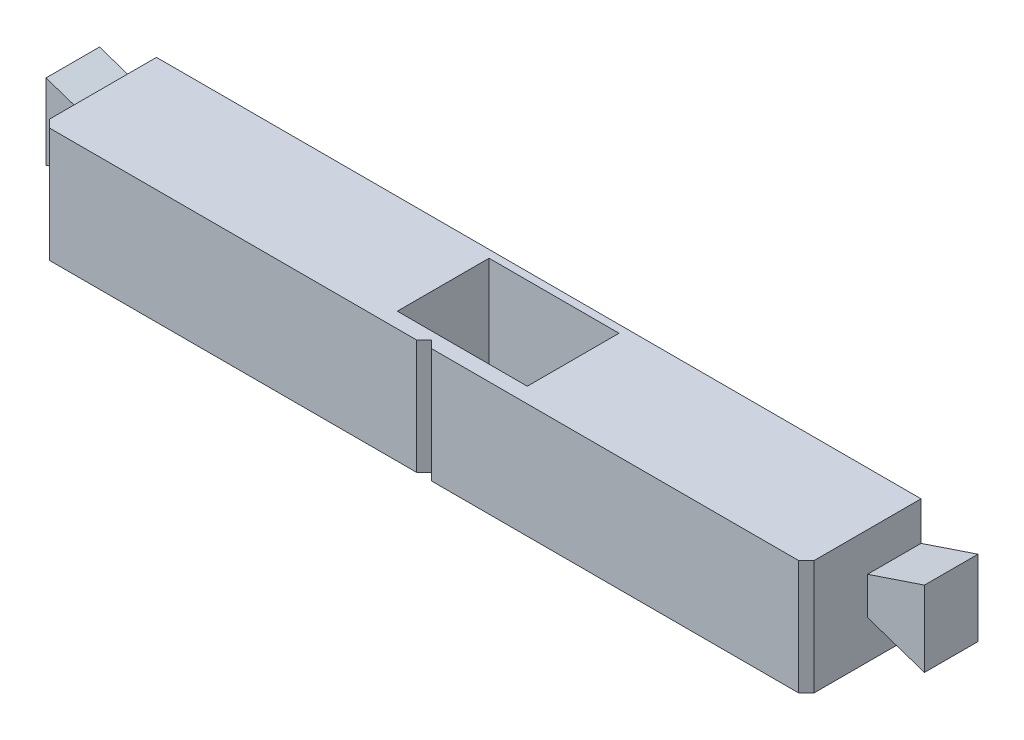
ISO-10303-21;
HEADER;
FILE_DESCRIPTION(('STEP AP214'),'2;1');
FILE_NAME('part.step','',(''),(''),'','','');
FILE_SCHEMA(('AUTOMOTIVE_DESIGN { 1 0 10303 214 1 1 1 1 }'));
ENDSEC;
DATA;
#1=APPLICATION_CONTEXT('core data for automotive mechanical design processes');
#2=APPLICATION_PROTOCOL_DEFINITION('international standard','automotive_design',2000,#1);
#3=PRODUCT_CONTEXT('',#1,'mechanical');
#4=PRODUCT('Part','Part','',(#3));
#5=PRODUCT_RELATED_PRODUCT_CATEGORY('part','',(#4));
#6=PRODUCT_DEFINITION_FORMATION('','',#4);
#7=PRODUCT_DEFINITION_CONTEXT('part definition',#1,'design');
#8=PRODUCT_DEFINITION('design','',#6,#7);
#9=PRODUCT_DEFINITION_SHAPE('','',#8);
#10=(LENGTH_UNIT() NAMED_UNIT(*) SI_UNIT(.MILLI.,.METRE.));
#11=(NAMED_UNIT(*) PLANE_ANGLE_UNIT() SI_UNIT($,.RADIAN.));
#12=(NAMED_UNIT(*) SI_UNIT($,.STERADIAN.) SOLID_ANGLE_UNIT());
#13=UNCERTAINTY_MEASURE_WITH_UNIT(LENGTH_MEASURE(1.E-05),#10,'distance_accuracy_value','');
#14=(GEOMETRIC_REPRESENTATION_CONTEXT(3) GLOBAL_UNCERTAINTY_ASSIGNED_CONTEXT((#13)) GLOBAL_UNIT_ASSIGNED_CONTEXT((#10,
#11,#12)) REPRESENTATION_CONTEXT('',''));
#15=CARTESIAN_POINT('',(0.,0.,0.));
#16=DIRECTION('',(0.,0.,1.));
#17=DIRECTION('',(1.,0.,0.));
#18=AXIS2_PLACEMENT_3D('',#15,#16,#17);
#19=CARTESIAN_POINT('',(5.50000000000003,-7.5,13.));
#20=DIRECTION('',(1.,0.,0.));
#21=DIRECTION('',(0.,0.,-1.));
#22=AXIS2_PLACEMENT_3D('',#19,#20,#21);
#23=PLANE('',#22);
#24=DIRECTION('',(0.,0.,1.));
#25=VECTOR('',#24,1.);
#26=CARTESIAN_POINT('',(5.50000000000003,-1.5,13.));
#27=LINE('',#26,#25);
#28=CARTESIAN_POINT('',(5.50000000000003,-1.5,0.999999999999997));
#29=VERTEX_POINT('',#28);
#30=CARTESIAN_POINT('',(5.50000000000003,-1.5,13.));
#31=VERTEX_POINT('',#30);
#32=EDGE_CURVE('E202',#29,#31,#27,.T.);
#33=ORIENTED_EDGE('',*,*,#32,.F.);
#34=DIRECTION('',(0.,1.,0.));
#35=VECTOR('',#34,1.);
#36=CARTESIAN_POINT('',(5.50000000000003,-7.5,0.999999999999997));
#37=LINE('',#36,#35);
#38=CARTESIAN_POINT('',(5.50000000000003,-7.5,0.999999999999997));
#39=VERTEX_POINT('',#38);
#40=EDGE_CURVE('E246',#39,#29,#37,.T.);
#41=ORIENTED_EDGE('',*,*,#40,.F.);
#42=DIRECTION('',(0.,0.,-1.));
#43=VECTOR('',#42,1.);
#44=CARTESIAN_POINT('',(5.50000000000003,-7.5,13.));
#45=LINE('',#44,#43);
#46=CARTESIAN_POINT('',(5.50000000000003,-7.5,13.));
#47=VERTEX_POINT('',#46);
#48=EDGE_CURVE('E232',#47,#39,#45,.T.);
#49=ORIENTED_EDGE('',*,*,#48,.F.);
#50=DIRECTION('',(0.,1.,0.));
#51=VECTOR('',#50,1.);
#52=CARTESIAN_POINT('',(5.50000000000003,-7.5,13.));
#53=LINE('',#52,#51);
#54=EDGE_CURVE('E247',#47,#31,#53,.T.);
#55=ORIENTED_EDGE('',*,*,#54,.T.);
#56=EDGE_LOOP('',(#33,#41,#49,#55));
#57=FACE_BOUND('',#56,.T.);
#58=ADVANCED_FACE('F41',(#57),#23,.F.);
#59=CARTESIAN_POINT('',(0.,0.,15.));
#60=DIRECTION('',(0.,0.,-1.));
#61=DIRECTION('',(-1.,0.,0.));
#62=AXIS2_PLACEMENT_3D('',#59,#60,#61);
#63=PLANE('',#62);
#64=DIRECTION('',(-1.,0.,0.));
#65=VECTOR('',#64,1.);
#66=CARTESIAN_POINT('',(-50.,7.5,15.));
#67=LINE('',#66,#65);
#68=CARTESIAN_POINT('',(49.,7.5,15.));
#69=VERTEX_POINT('',#68);
#70=CARTESIAN_POINT('',(1.,7.5,15.));
#71=VERTEX_POINT('',#70);
#72=EDGE_CURVE('E351',#69,#71,#67,.T.);
#73=ORIENTED_EDGE('',*,*,#72,.T.);
#74=DIRECTION('',(0.,1.,0.));
#75=VECTOR('',#74,1.);
#76=CARTESIAN_POINT('',(1.,-7.5,15.));
#77=LINE('',#76,#75);
#78=CARTESIAN_POINT('',(1.,-7.5,15.));
#79=VERTEX_POINT('',#78);
#80=EDGE_CURVE('E268',#79,#71,#77,.T.);
#81=ORIENTED_EDGE('',*,*,#80,.F.);
#82=DIRECTION('',(1.,0.,0.));
#83=VECTOR('',#82,1.);
#84=CARTESIAN_POINT('',(-50.,-7.5,15.));
#85=LINE('',#84,#83);
#86=CARTESIAN_POINT('',(49.,-7.5,15.));
#87=VERTEX_POINT('',#86);
#88=EDGE_CURVE('E355',#79,#87,#85,.T.);
#89=ORIENTED_EDGE('',*,*,#88,.T.);
#90=DIRECTION('',(0.,1.,0.));
#91=VECTOR('',#90,1.);
#92=CARTESIAN_POINT('',(49.,0.,15.));
#93=LINE('',#92,#91);
#94=EDGE_CURVE('E390',#87,#69,#93,.T.);
#95=ORIENTED_EDGE('',*,*,#94,.T.);
#96=EDGE_LOOP('',(#73,#81,#89,#95));
#97=FACE_BOUND('',#96,.T.);
#98=ADVANCED_FACE('F455',(#97),#63,.F.);
#99=CARTESIAN_POINT('',(50.,-7.5,15.));
#100=DIRECTION('',(-1.,0.,0.));
#101=DIRECTION('',(0.,0.,1.));
#102=AXIS2_PLACEMENT_3D('',#99,#100,#101);
#103=PLANE('',#102);
#104=DIRECTION('',(0.,0.,-1.));
#105=VECTOR('',#104,1.);
#106=CARTESIAN_POINT('',(50.,7.5,15.));
#107=LINE('',#106,#105);
#108=CARTESIAN_POINT('',(50.,7.5,14.));
#109=VERTEX_POINT('',#108);
#110=CARTESIAN_POINT('',(50.,7.5,0.));
#111=VERTEX_POINT('',#110);
#112=EDGE_CURVE('E387',#109,#111,#107,.T.);
#113=ORIENTED_EDGE('',*,*,#112,.F.);
#114=DIRECTION('',(0.,-1.,0.));
#115=VECTOR('',#114,1.);
#116=CARTESIAN_POINT('',(50.,-7.5,14.));
#117=LINE('',#116,#115);
#118=CARTESIAN_POINT('',(50.,-7.5,14.));
#119=VERTEX_POINT('',#118);
#120=EDGE_CURVE('E415',#109,#119,#117,.T.);
#121=ORIENTED_EDGE('',*,*,#120,.T.);
#122=DIRECTION('',(0.,0.,-1.));
#123=VECTOR('',#122,1.);
#124=CARTESIAN_POINT('',(50.,-7.5,15.));
#125=LINE('',#124,#123);
#126=CARTESIAN_POINT('',(50.,-7.5,0.));
#127=VERTEX_POINT('',#126);
#128=EDGE_CURVE('E361',#119,#127,#125,.T.);
#129=ORIENTED_EDGE('',*,*,#128,.T.);
#130=DIRECTION('',(0.,1.,0.));
#131=VECTOR('',#130,1.);
#132=CARTESIAN_POINT('',(50.,-7.5,0.));
#133=LINE('',#132,#131);
#134=CARTESIAN_POINT('',(50.,-2.44999999999999,0.));
#135=VERTEX_POINT('',#134);
#136=EDGE_CURVE('E362',#127,#135,#133,.T.);
#137=ORIENTED_EDGE('',*,*,#136,.T.);
#138=DIRECTION('',(0.,0.,-1.));
#139=VECTOR('',#138,1.);
#140=CARTESIAN_POINT('',(50.,-2.44999999999999,7.));
#141=LINE('',#140,#139);
#142=CARTESIAN_POINT('',(50.,-2.44999999999999,7.));
#143=VERTEX_POINT('',#142);
#144=EDGE_CURVE('E310',#143,#135,#141,.T.);
#145=ORIENTED_EDGE('',*,*,#144,.F.);
#146=DIRECTION('',(0.,-1.,0.));
#147=VECTOR('',#146,1.);
#148=CARTESIAN_POINT('',(50.,0.,7.));
#149=LINE('',#148,#147);
#150=CARTESIAN_POINT('',(50.,2.45000000000001,7.));
#151=VERTEX_POINT('',#150);
#152=EDGE_CURVE('E277',#151,#143,#149,.T.);
#153=ORIENTED_EDGE('',*,*,#152,.F.);
#154=DIRECTION('',(0.,0.,-1.));
#155=VECTOR('',#154,1.);
#156=CARTESIAN_POINT('',(50.,2.45000000000001,7.));
#157=LINE('',#156,#155);
#158=CARTESIAN_POINT('',(50.,2.45000000000001,0.));
#159=VERTEX_POINT('',#158);
#160=EDGE_CURVE('E290',#151,#159,#157,.T.);
#161=ORIENTED_EDGE('',*,*,#160,.T.);
#162=EDGE_CURVE('E350',#159,#111,#133,.T.);
#163=ORIENTED_EDGE('',*,*,#162,.T.);
#164=EDGE_LOOP('',(#113,#121,#129,#137,#145,#153,#161,#163));
#165=FACE_BOUND('',#164,.T.);
#166=ADVANCED_FACE('F464',(#165),#103,.F.);
#167=CARTESIAN_POINT('',(-50.,-7.5,15.));
#168=DIRECTION('',(1.,0.,0.));
#169=DIRECTION('',(0.,0.,-1.));
#170=AXIS2_PLACEMENT_3D('',#167,#168,#169);
#171=PLANE('',#170);
#172=DIRECTION('',(0.,0.,-1.));
#173=VECTOR('',#172,1.);
#174=CARTESIAN_POINT('',(-50.,-7.5,15.));
#175=LINE('',#174,#173);
#176=CARTESIAN_POINT('',(-50.,-7.5,14.));
#177=VERTEX_POINT('',#176);
#178=CARTESIAN_POINT('',(-50.,-7.5,0.));
#179=VERTEX_POINT('',#178);
#180=EDGE_CURVE('E381',#177,#179,#175,.T.);
#181=ORIENTED_EDGE('',*,*,#180,.F.);
#182=DIRECTION('',(0.,1.,0.));
#183=VECTOR('',#182,1.);
#184=CARTESIAN_POINT('',(-50.,-7.5,14.));
#185=LINE('',#184,#183);
#186=CARTESIAN_POINT('',(-50.,7.5,14.));
#187=VERTEX_POINT('',#186);
#188=EDGE_CURVE('E405',#177,#187,#185,.T.);
#189=ORIENTED_EDGE('',*,*,#188,.T.);
#190=DIRECTION('',(0.,0.,-1.));
#191=VECTOR('',#190,1.);
#192=CARTESIAN_POINT('',(-50.,7.5,15.));
#193=LINE('',#192,#191);
#194=CARTESIAN_POINT('',(-50.,7.5,0.));
#195=VERTEX_POINT('',#194);
#196=EDGE_CURVE('E384',#187,#195,#193,.T.);
#197=ORIENTED_EDGE('',*,*,#196,.T.);
#198=DIRECTION('',(0.,-1.,0.));
#199=VECTOR('',#198,1.);
#200=CARTESIAN_POINT('',(-50.,-7.5,0.));
#201=LINE('',#200,#199);
#202=CARTESIAN_POINT('',(-50.,2.45,0.));
#203=VERTEX_POINT('',#202);
#204=EDGE_CURVE('E371',#195,#203,#201,.T.);
#205=ORIENTED_EDGE('',*,*,#204,.T.);
#206=DIRECTION('',(0.,0.,-1.));
#207=VECTOR('',#206,1.);
#208=CARTESIAN_POINT('',(-50.,2.45,7.));
#209=LINE('',#208,#207);
#210=CARTESIAN_POINT('',(-50.,2.45,7.));
#211=VERTEX_POINT('',#210);
#212=EDGE_CURVE('E347',#211,#203,#209,.T.);
#213=ORIENTED_EDGE('',*,*,#212,.F.);
#214=DIRECTION('',(0.,1.,0.));
#215=VECTOR('',#214,1.);
#216=CARTESIAN_POINT('',(-50.,-2.45,7.));
#217=LINE('',#216,#215);
#218=CARTESIAN_POINT('',(-50.,-2.45,7.));
#219=VERTEX_POINT('',#218);
#220=EDGE_CURVE('E314',#219,#211,#217,.T.);
#221=ORIENTED_EDGE('',*,*,#220,.F.);
#222=DIRECTION('',(0.,0.,-1.));
#223=VECTOR('',#222,1.);
#224=CARTESIAN_POINT('',(-50.,-2.45,7.));
#225=LINE('',#224,#223);
#226=CARTESIAN_POINT('',(-50.,-2.45,0.));
#227=VERTEX_POINT('',#226);
#228=EDGE_CURVE('E327',#219,#227,#225,.T.);
#229=ORIENTED_EDGE('',*,*,#228,.T.);
#230=EDGE_CURVE('E370',#227,#179,#201,.T.);
#231=ORIENTED_EDGE('',*,*,#230,.T.);
#232=EDGE_LOOP('',(#181,#189,#197,#205,#213,#221,#229,#231));
#233=FACE_BOUND('',#232,.T.);
#234=ADVANCED_FACE('F480',(#233),#171,.F.);
#235=CARTESIAN_POINT('',(-50.,7.5,15.));
#236=DIRECTION('',(0.,-1.,0.));
#237=DIRECTION('',(0.,0.,-1.));
#238=AXIS2_PLACEMENT_3D('',#235,#236,#237);
#239=PLANE('',#238);
#240=DIRECTION('',(1.,0.,0.));
#241=VECTOR('',#240,1.);
#242=CARTESIAN_POINT('',(-50.,7.5,1.00000000000001));
#243=LINE('',#242,#241);
#244=CARTESIAN_POINT('',(-5.49999999999997,7.5,1.));
#245=VERTEX_POINT('',#244);
#246=CARTESIAN_POINT('',(11.5,7.5,1.));
#247=VERTEX_POINT('',#246);
#248=EDGE_CURVE('E250',#245,#247,#243,.T.);
#249=ORIENTED_EDGE('',*,*,#248,.T.);
#250=DIRECTION('',(0.,0.,-1.));
#251=VECTOR('',#250,1.);
#252=CARTESIAN_POINT('',(11.5,7.5,1.));
#253=LINE('',#252,#251);
#254=CARTESIAN_POINT('',(11.5,7.5,13.));
#255=VERTEX_POINT('',#254);
#256=EDGE_CURVE('E206',#255,#247,#253,.T.);
#257=ORIENTED_EDGE('',*,*,#256,.F.);
#258=DIRECTION('',(-1.,0.,0.));
#259=VECTOR('',#258,1.);
#260=CARTESIAN_POINT('',(-50.,7.5,13.));
#261=LINE('',#260,#259);
#262=CARTESIAN_POINT('',(-5.49999999999997,7.5,13.));
#263=VERTEX_POINT('',#262);
#264=EDGE_CURVE('E212',#255,#263,#261,.T.);
#265=ORIENTED_EDGE('',*,*,#264,.T.);
#266=DIRECTION('',(0.,0.,-1.));
#267=VECTOR('',#266,1.);
#268=CARTESIAN_POINT('',(-5.49999999999997,7.5,15.));
#269=LINE('',#268,#267);
#270=EDGE_CURVE('E262',#263,#245,#269,.T.);
#271=ORIENTED_EDGE('',*,*,#270,.T.);
#272=EDGE_LOOP('',(#249,#257,#265,#271));
#273=FACE_BOUND('',#272,.T.);
#274=CARTESIAN_POINT('',(-1.,7.5,15.));
#275=VERTEX_POINT('',#274);
#276=CARTESIAN_POINT('',(-49.,7.5,15.));
#277=VERTEX_POINT('',#276);
#278=EDGE_CURVE('E356',#275,#277,#67,.T.);
#279=ORIENTED_EDGE('',*,*,#278,.F.);
#280=DIRECTION('',(-0.70710678118655,0.,0.707106781186545));
#281=VECTOR('',#280,1.);
#282=CARTESIAN_POINT('',(-25.5000000000002,7.5,39.5));
#283=LINE('',#282,#281);
#284=CARTESIAN_POINT('',(0.,7.5,14.));
#285=VERTEX_POINT('',#284);
#286=EDGE_CURVE('E11',#275,#285,#283,.F.);
#287=ORIENTED_EDGE('',*,*,#286,.T.);
#288=DIRECTION('',(-0.70710678118655,0.,-0.707106781186545));
#289=VECTOR('',#288,1.);
#290=CARTESIAN_POINT('',(-24.5000000000002,7.5,-10.5));
#291=LINE('',#290,#289);
#292=EDGE_CURVE('E418',#285,#71,#291,.F.);
#293=ORIENTED_EDGE('',*,*,#292,.T.);
#294=ORIENTED_EDGE('',*,*,#72,.F.);
#295=DIRECTION('',(-0.707106781186543,0.,0.707106781186552));
#296=VECTOR('',#295,1.);
#297=CARTESIAN_POINT('',(49.,7.5,15.));
#298=LINE('',#297,#296);
#299=EDGE_CURVE('E408',#69,#109,#298,.F.);
#300=ORIENTED_EDGE('',*,*,#299,.T.);
#301=ORIENTED_EDGE('',*,*,#112,.T.);
#302=DIRECTION('',(-1.,0.,0.));
#303=VECTOR('',#302,1.);
#304=CARTESIAN_POINT('',(-50.,7.5,0.));
#305=LINE('',#304,#303);
#306=EDGE_CURVE('E366',#111,#195,#305,.T.);
#307=ORIENTED_EDGE('',*,*,#306,.T.);
#308=ORIENTED_EDGE('',*,*,#196,.F.);
#309=DIRECTION('',(-0.707106781186543,0.,-0.707106781186552));
#310=VECTOR('',#309,1.);
#311=CARTESIAN_POINT('',(-49.,7.5,15.));
#312=LINE('',#311,#310);
#313=EDGE_CURVE('E411',#187,#277,#312,.F.);
#314=ORIENTED_EDGE('',*,*,#313,.T.);
#315=EDGE_LOOP('',(#279,#287,#293,#294,#300,#301,#307,#308,#314));
#316=FACE_BOUND('',#315,.T.);
#317=ADVANCED_FACE('F440',(#273,#316),#239,.F.);
#318=CARTESIAN_POINT('',(-50.,-7.5,15.));
#319=DIRECTION('',(0.,1.,0.));
#320=DIRECTION('',(0.,0.,1.));
#321=AXIS2_PLACEMENT_3D('',#318,#319,#320);
#322=PLANE('',#321);
#323=DIRECTION('',(1.,0.,0.));
#324=VECTOR('',#323,1.);
#325=CARTESIAN_POINT('',(-5.49999999999997,-7.5,13.));
#326=LINE('',#325,#324);
#327=CARTESIAN_POINT('',(-5.49999999999997,-7.5,13.));
#328=VERTEX_POINT('',#327);
#329=EDGE_CURVE('E242',#328,#47,#326,.T.);
#330=ORIENTED_EDGE('',*,*,#329,.T.);
#331=ORIENTED_EDGE('',*,*,#48,.T.);
#332=DIRECTION('',(-1.,0.,0.));
#333=VECTOR('',#332,1.);
#334=CARTESIAN_POINT('',(-5.49999999999997,-7.5,1.));
#335=LINE('',#334,#333);
#336=CARTESIAN_POINT('',(-5.49999999999997,-7.5,1.));
#337=VERTEX_POINT('',#336);
#338=EDGE_CURVE('E236',#39,#337,#335,.T.);
#339=ORIENTED_EDGE('',*,*,#338,.T.);
#340=DIRECTION('',(0.,0.,1.));
#341=VECTOR('',#340,1.);
#342=CARTESIAN_POINT('',(-5.49999999999997,-7.5,13.));
#343=LINE('',#342,#341);
#344=EDGE_CURVE('E67',#337,#328,#343,.T.);
#345=ORIENTED_EDGE('',*,*,#344,.T.);
#346=EDGE_LOOP('',(#330,#331,#339,#345));
#347=FACE_BOUND('',#346,.T.);
#348=ORIENTED_EDGE('',*,*,#88,.F.);
#349=DIRECTION('',(0.70710678118655,0.,0.707106781186545));
#350=VECTOR('',#349,1.);
#351=CARTESIAN_POINT('',(-24.5000000000002,-7.5,-10.5));
#352=LINE('',#351,#350);
#353=CARTESIAN_POINT('',(0.,-7.5,14.));
#354=VERTEX_POINT('',#353);
#355=EDGE_CURVE('E421',#79,#354,#352,.F.);
#356=ORIENTED_EDGE('',*,*,#355,.T.);
#357=DIRECTION('',(0.70710678118655,0.,-0.707106781186545));
#358=VECTOR('',#357,1.);
#359=CARTESIAN_POINT('',(-25.5000000000002,-7.5,39.5));
#360=LINE('',#359,#358);
#361=CARTESIAN_POINT('',(-1.,-7.5,15.));
#362=VERTEX_POINT('',#361);
#363=EDGE_CURVE('E52',#354,#362,#360,.F.);
#364=ORIENTED_EDGE('',*,*,#363,.T.);
#365=CARTESIAN_POINT('',(-49.,-7.5,15.));
#366=VERTEX_POINT('',#365);
#367=EDGE_CURVE('E357',#366,#362,#85,.T.);
#368=ORIENTED_EDGE('',*,*,#367,.F.);
#369=DIRECTION('',(0.707106781186543,0.,0.707106781186552));
#370=VECTOR('',#369,1.);
#371=CARTESIAN_POINT('',(-49.,-7.5,15.));
#372=LINE('',#371,#370);
#373=EDGE_CURVE('E402',#366,#177,#372,.F.);
#374=ORIENTED_EDGE('',*,*,#373,.T.);
#375=ORIENTED_EDGE('',*,*,#180,.T.);
#376=DIRECTION('',(1.,0.,0.));
#377=VECTOR('',#376,1.);
#378=CARTESIAN_POINT('',(-50.,-7.5,0.));
#379=LINE('',#378,#377);
#380=EDGE_CURVE('E375',#179,#127,#379,.T.);
#381=ORIENTED_EDGE('',*,*,#380,.T.);
#382=ORIENTED_EDGE('',*,*,#128,.F.);
#383=DIRECTION('',(0.707106781186543,0.,-0.707106781186552));
#384=VECTOR('',#383,1.);
#385=CARTESIAN_POINT('',(49.,-7.5,15.));
#386=LINE('',#385,#384);
#387=EDGE_CURVE('E398',#119,#87,#386,.F.);
#388=ORIENTED_EDGE('',*,*,#387,.T.);
#389=EDGE_LOOP('',(#348,#356,#364,#368,#374,#375,#381,#382,#388));
#390=FACE_BOUND('',#389,.T.);
#391=ADVANCED_FACE('F429',(#347,#390),#322,.F.);
#392=ORIENTED_EDGE('',*,*,#367,.T.);
#393=DIRECTION('',(0.,-1.,0.));
#394=VECTOR('',#393,1.);
#395=CARTESIAN_POINT('',(-1.,-7.5,15.));
#396=LINE('',#395,#394);
#397=EDGE_CURVE('E272',#275,#362,#396,.T.);
#398=ORIENTED_EDGE('',*,*,#397,.F.);
#399=ORIENTED_EDGE('',*,*,#278,.T.);
#400=DIRECTION('',(0.,-1.,0.));
#401=VECTOR('',#400,1.);
#402=CARTESIAN_POINT('',(-49.,0.,15.));
#403=LINE('',#402,#401);
#404=EDGE_CURVE('E394',#277,#366,#403,.T.);
#405=ORIENTED_EDGE('',*,*,#404,.T.);
#406=EDGE_LOOP('',(#392,#398,#399,#405));
#407=FACE_BOUND('',#406,.T.);
#408=ADVANCED_FACE('F434',(#407),#63,.F.);
#409=CARTESIAN_POINT('',(0.,0.,0.));
#410=DIRECTION('',(0.,0.,-1.));
#411=DIRECTION('',(-1.,0.,0.));
#412=AXIS2_PLACEMENT_3D('',#409,#410,#411);
#413=PLANE('',#412);
#414=ORIENTED_EDGE('',*,*,#136,.F.);
#415=ORIENTED_EDGE('',*,*,#380,.F.);
#416=ORIENTED_EDGE('',*,*,#230,.F.);
#417=DIRECTION('',(0.948045105831673,0.318135941554253,0.));
#418=VECTOR('',#417,1.);
#419=CARTESIAN_POINT('',(-57.45,-4.95,0.));
#420=LINE('',#419,#418);
#421=CARTESIAN_POINT('',(-57.45,-4.95,0.));
#422=VERTEX_POINT('',#421);
#423=EDGE_CURVE('E318',#422,#227,#420,.T.);
#424=ORIENTED_EDGE('',*,*,#423,.F.);
#425=DIRECTION('',(0.,-1.,0.));
#426=VECTOR('',#425,1.);
#427=CARTESIAN_POINT('',(-57.45,0.,0.));
#428=LINE('',#427,#426);
#429=CARTESIAN_POINT('',(-57.45,4.95,0.));
#430=VERTEX_POINT('',#429);
#431=EDGE_CURVE('E331',#430,#422,#428,.T.);
#432=ORIENTED_EDGE('',*,*,#431,.F.);
#433=DIRECTION('',(-0.948045105831674,0.318135941554253,0.));
#434=VECTOR('',#433,1.);
#435=CARTESIAN_POINT('',(-50.,2.45,0.));
#436=LINE('',#435,#434);
#437=EDGE_CURVE('E313',#203,#430,#436,.T.);
#438=ORIENTED_EDGE('',*,*,#437,.F.);
#439=ORIENTED_EDGE('',*,*,#204,.F.);
#440=ORIENTED_EDGE('',*,*,#306,.F.);
#441=ORIENTED_EDGE('',*,*,#162,.F.);
#442=DIRECTION('',(-0.948045105831673,-0.318135941554253,0.));
#443=VECTOR('',#442,1.);
#444=CARTESIAN_POINT('',(50.,2.45000000000001,0.));
#445=LINE('',#444,#443);
#446=CARTESIAN_POINT('',(57.45,4.95000000000001,0.));
#447=VERTEX_POINT('',#446);
#448=EDGE_CURVE('E281',#447,#159,#445,.T.);
#449=ORIENTED_EDGE('',*,*,#448,.F.);
#450=DIRECTION('',(0.,1.,0.));
#451=VECTOR('',#450,1.);
#452=CARTESIAN_POINT('',(57.45,4.95000000000001,0.));
#453=LINE('',#452,#451);
#454=CARTESIAN_POINT('',(57.45,-4.94999999999999,0.));
#455=VERTEX_POINT('',#454);
#456=EDGE_CURVE('E294',#455,#447,#453,.T.);
#457=ORIENTED_EDGE('',*,*,#456,.F.);
#458=DIRECTION('',(0.948045105831674,-0.318135941554253,0.));
#459=VECTOR('',#458,1.);
#460=CARTESIAN_POINT('',(57.45,-4.94999999999999,0.));
#461=LINE('',#460,#459);
#462=EDGE_CURVE('E276',#135,#455,#461,.T.);
#463=ORIENTED_EDGE('',*,*,#462,.F.);
#464=EDGE_LOOP('',(#414,#415,#416,#424,#432,#438,#439,#440,#441,#449,#457,#463));
#465=FACE_BOUND('',#464,.T.);
#466=ADVANCED_FACE('F473',(#465),#413,.T.);
#467=CARTESIAN_POINT('',(-50.,2.45,7.));
#468=DIRECTION('',(-0.318135941554253,-0.948045105831673,0.));
#469=DIRECTION('',(0.948045105831674,-0.318135941554253,0.));
#470=AXIS2_PLACEMENT_3D('',#467,#468,#469);
#471=PLANE('',#470);
#472=ORIENTED_EDGE('',*,*,#437,.T.);
#473=DIRECTION('',(0.,0.,-1.));
#474=VECTOR('',#473,1.);
#475=CARTESIAN_POINT('',(-57.45,4.95,7.));
#476=LINE('',#475,#474);
#477=CARTESIAN_POINT('',(-57.45,4.95,7.));
#478=VERTEX_POINT('',#477);
#479=EDGE_CURVE('E343',#478,#430,#476,.T.);
#480=ORIENTED_EDGE('',*,*,#479,.F.);
#481=DIRECTION('',(-0.948045105831674,0.318135941554253,0.));
#482=VECTOR('',#481,1.);
#483=CARTESIAN_POINT('',(-50.,2.45,7.));
#484=LINE('',#483,#482);
#485=EDGE_CURVE('E317',#211,#478,#484,.T.);
#486=ORIENTED_EDGE('',*,*,#485,.F.);
#487=ORIENTED_EDGE('',*,*,#212,.T.);
#488=EDGE_LOOP('',(#472,#480,#486,#487));
#489=FACE_BOUND('',#488,.T.);
#490=ADVANCED_FACE('F585',(#489),#471,.F.);
#491=CARTESIAN_POINT('',(-57.45,0.,7.));
#492=DIRECTION('',(1.,0.,0.));
#493=DIRECTION('',(0.,0.,-1.));
#494=AXIS2_PLACEMENT_3D('',#491,#492,#493);
#495=PLANE('',#494);
#496=ORIENTED_EDGE('',*,*,#431,.T.);
#497=DIRECTION('',(0.,0.,-1.));
#498=VECTOR('',#497,1.);
#499=CARTESIAN_POINT('',(-57.45,-4.95,7.));
#500=LINE('',#499,#498);
#501=CARTESIAN_POINT('',(-57.45,-4.95,7.));
#502=VERTEX_POINT('',#501);
#503=EDGE_CURVE('E339',#502,#422,#500,.T.);
#504=ORIENTED_EDGE('',*,*,#503,.F.);
#505=DIRECTION('',(0.,-1.,0.));
#506=VECTOR('',#505,1.);
#507=CARTESIAN_POINT('',(-57.45,4.95,7.));
#508=LINE('',#507,#506);
#509=EDGE_CURVE('E321',#478,#502,#508,.T.);
#510=ORIENTED_EDGE('',*,*,#509,.F.);
#511=ORIENTED_EDGE('',*,*,#479,.T.);
#512=EDGE_LOOP('',(#496,#504,#510,#511));
#513=FACE_BOUND('',#512,.T.);
#514=ADVANCED_FACE('F592',(#513),#495,.F.);
#515=CARTESIAN_POINT('',(-57.45,-4.95,7.));
#516=DIRECTION('',(-0.318135941554253,0.948045105831673,0.));
#517=DIRECTION('',(-0.948045105831674,-0.318135941554253,0.));
#518=AXIS2_PLACEMENT_3D('',#515,#516,#517);
#519=PLANE('',#518);
#520=ORIENTED_EDGE('',*,*,#423,.T.);
#521=ORIENTED_EDGE('',*,*,#228,.F.);
#522=DIRECTION('',(0.948045105831673,0.318135941554253,0.));
#523=VECTOR('',#522,1.);
#524=CARTESIAN_POINT('',(-57.45,-4.95,7.));
#525=LINE('',#524,#523);
#526=EDGE_CURVE('E324',#502,#219,#525,.T.);
#527=ORIENTED_EDGE('',*,*,#526,.F.);
#528=ORIENTED_EDGE('',*,*,#503,.T.);
#529=EDGE_LOOP('',(#520,#521,#527,#528));
#530=FACE_BOUND('',#529,.T.);
#531=ADVANCED_FACE('F600',(#530),#519,.F.);
#532=CARTESIAN_POINT('',(0.,0.,7.));
#533=DIRECTION('',(0.,0.,1.));
#534=DIRECTION('',(1.,0.,0.));
#535=AXIS2_PLACEMENT_3D('',#532,#533,#534);
#536=PLANE('',#535);
#537=ORIENTED_EDGE('',*,*,#220,.T.);
#538=ORIENTED_EDGE('',*,*,#485,.T.);
#539=ORIENTED_EDGE('',*,*,#509,.T.);
#540=ORIENTED_EDGE('',*,*,#526,.T.);
#541=EDGE_LOOP('',(#537,#538,#539,#540));
#542=FACE_BOUND('',#541,.T.);
#543=ADVANCED_FACE('F508',(#542),#536,.T.);
#544=CARTESIAN_POINT('',(57.45,-4.94999999999999,7.));
#545=DIRECTION('',(0.318135941554253,0.948045105831673,0.));
#546=DIRECTION('',(-0.948045105831674,0.318135941554253,0.));
#547=AXIS2_PLACEMENT_3D('',#544,#545,#546);
#548=PLANE('',#547);
#549=ORIENTED_EDGE('',*,*,#462,.T.);
#550=DIRECTION('',(0.,0.,-1.));
#551=VECTOR('',#550,1.);
#552=CARTESIAN_POINT('',(57.45,-4.94999999999999,7.));
#553=LINE('',#552,#551);
#554=CARTESIAN_POINT('',(57.45,-4.94999999999999,7.));
#555=VERTEX_POINT('',#554);
#556=EDGE_CURVE('E306',#555,#455,#553,.T.);
#557=ORIENTED_EDGE('',*,*,#556,.F.);
#558=DIRECTION('',(0.948045105831674,-0.318135941554253,0.));
#559=VECTOR('',#558,1.);
#560=CARTESIAN_POINT('',(57.45,-4.94999999999999,7.));
#561=LINE('',#560,#559);
#562=EDGE_CURVE('E280',#143,#555,#561,.T.);
#563=ORIENTED_EDGE('',*,*,#562,.F.);
#564=ORIENTED_EDGE('',*,*,#144,.T.);
#565=EDGE_LOOP('',(#549,#557,#563,#564));
#566=FACE_BOUND('',#565,.T.);
#567=ADVANCED_FACE('F490',(#566),#548,.F.);
#568=CARTESIAN_POINT('',(57.45,4.95000000000001,7.));
#569=DIRECTION('',(-1.,0.,0.));
#570=DIRECTION('',(0.,0.,1.));
#571=AXIS2_PLACEMENT_3D('',#568,#569,#570);
#572=PLANE('',#571);
#573=ORIENTED_EDGE('',*,*,#456,.T.);
#574=DIRECTION('',(0.,0.,-1.));
#575=VECTOR('',#574,1.);
#576=CARTESIAN_POINT('',(57.45,4.95000000000001,7.));
#577=LINE('',#576,#575);
#578=CARTESIAN_POINT('',(57.45,4.95000000000001,7.));
#579=VERTEX_POINT('',#578);
#580=EDGE_CURVE('E302',#579,#447,#577,.T.);
#581=ORIENTED_EDGE('',*,*,#580,.F.);
#582=DIRECTION('',(0.,1.,0.));
#583=VECTOR('',#582,1.);
#584=CARTESIAN_POINT('',(57.45,0.,7.));
#585=LINE('',#584,#583);
#586=EDGE_CURVE('E284',#555,#579,#585,.T.);
#587=ORIENTED_EDGE('',*,*,#586,.F.);
#588=ORIENTED_EDGE('',*,*,#556,.T.);
#589=EDGE_LOOP('',(#573,#581,#587,#588));
#590=FACE_BOUND('',#589,.T.);
#591=ADVANCED_FACE('F500',(#590),#572,.F.);
#592=CARTESIAN_POINT('',(50.,2.45000000000001,7.));
#593=DIRECTION('',(0.318135941554253,-0.948045105831673,0.));
#594=DIRECTION('',(0.948045105831674,0.318135941554253,0.));
#595=AXIS2_PLACEMENT_3D('',#592,#593,#594);
#596=PLANE('',#595);
#597=ORIENTED_EDGE('',*,*,#448,.T.);
#598=ORIENTED_EDGE('',*,*,#160,.F.);
#599=DIRECTION('',(-0.948045105831673,-0.318135941554253,0.));
#600=VECTOR('',#599,1.);
#601=CARTESIAN_POINT('',(50.,2.45000000000001,7.));
#602=LINE('',#601,#600);
#603=EDGE_CURVE('E287',#579,#151,#602,.T.);
#604=ORIENTED_EDGE('',*,*,#603,.F.);
#605=ORIENTED_EDGE('',*,*,#580,.T.);
#606=EDGE_LOOP('',(#597,#598,#604,#605));
#607=FACE_BOUND('',#606,.T.);
#608=ADVANCED_FACE('F498',(#607),#596,.F.);
#609=CARTESIAN_POINT('',(0.,0.,7.));
#610=DIRECTION('',(0.,0.,-1.));
#611=DIRECTION('',(-1.,0.,0.));
#612=AXIS2_PLACEMENT_3D('',#609,#610,#611);
#613=PLANE('',#612);
#614=ORIENTED_EDGE('',*,*,#152,.T.);
#615=ORIENTED_EDGE('',*,*,#562,.T.);
#616=ORIENTED_EDGE('',*,*,#586,.T.);
#617=ORIENTED_EDGE('',*,*,#603,.T.);
#618=EDGE_LOOP('',(#614,#615,#616,#617));
#619=FACE_BOUND('',#618,.T.);
#620=ADVANCED_FACE('F494',(#619),#613,.F.);
#621=CARTESIAN_POINT('',(-49.,0.,15.));
#622=DIRECTION('',(0.707106781186552,0.,-0.707106781186543));
#623=DIRECTION('',(0.,-1.,0.));
#624=AXIS2_PLACEMENT_3D('',#621,#622,#623);
#625=PLANE('',#624);
#626=ORIENTED_EDGE('',*,*,#313,.F.);
#627=ORIENTED_EDGE('',*,*,#188,.F.);
#628=ORIENTED_EDGE('',*,*,#373,.F.);
#629=ORIENTED_EDGE('',*,*,#404,.F.);
#630=EDGE_LOOP('',(#626,#627,#628,#629));
#631=FACE_BOUND('',#630,.T.);
#632=ADVANCED_FACE('F478',(#631),#625,.F.);
#633=CARTESIAN_POINT('',(49.,0.,15.));
#634=DIRECTION('',(-0.707106781186552,0.,-0.707106781186543));
#635=DIRECTION('',(0.,1.,0.));
#636=AXIS2_PLACEMENT_3D('',#633,#634,#635);
#637=PLANE('',#636);
#638=ORIENTED_EDGE('',*,*,#387,.F.);
#639=ORIENTED_EDGE('',*,*,#120,.F.);
#640=ORIENTED_EDGE('',*,*,#299,.F.);
#641=ORIENTED_EDGE('',*,*,#94,.F.);
#642=EDGE_LOOP('',(#638,#639,#640,#641));
#643=FACE_BOUND('',#642,.T.);
#644=ADVANCED_FACE('F461',(#643),#637,.F.);
#645=CARTESIAN_POINT('',(1.00000000000002,0.,13.));
#646=DIRECTION('',(0.707106781186545,0.,0.70710678118655));
#647=DIRECTION('',(0.,1.,0.));
#648=AXIS2_PLACEMENT_3D('',#645,#646,#647);
#649=PLANE('',#648);
#650=ORIENTED_EDGE('',*,*,#397,.T.);
#651=ORIENTED_EDGE('',*,*,#363,.F.);
#652=DIRECTION('',(0.,1.,0.));
#653=VECTOR('',#652,1.);
#654=CARTESIAN_POINT('',(0.,0.,14.));
#655=LINE('',#654,#653);
#656=EDGE_CURVE('E46',#285,#354,#655,.F.);
#657=ORIENTED_EDGE('',*,*,#656,.F.);
#658=ORIENTED_EDGE('',*,*,#286,.F.);
#659=EDGE_LOOP('',(#650,#651,#657,#658));
#660=FACE_BOUND('',#659,.T.);
#661=ADVANCED_FACE('F44',(#660),#649,.T.);
#662=CARTESIAN_POINT('',(-1.00000000000002,0.,13.));
#663=DIRECTION('',(-0.707106781186545,0.,0.70710678118655));
#664=DIRECTION('',(0.,-1.,0.));
#665=AXIS2_PLACEMENT_3D('',#662,#663,#664);
#666=PLANE('',#665);
#667=ORIENTED_EDGE('',*,*,#355,.F.);
#668=ORIENTED_EDGE('',*,*,#80,.T.);
#669=ORIENTED_EDGE('',*,*,#292,.F.);
#670=ORIENTED_EDGE('',*,*,#656,.T.);
#671=EDGE_LOOP('',(#667,#668,#669,#670));
#672=FACE_BOUND('',#671,.T.);
#673=ADVANCED_FACE('F452',(#672),#666,.T.);
#674=CARTESIAN_POINT('',(-5.49999999999997,-7.5,13.));
#675=DIRECTION('',(0.,0.,1.));
#676=DIRECTION('',(1.,0.,0.));
#677=AXIS2_PLACEMENT_3D('',#674,#675,#676);
#678=PLANE('',#677);
#679=ORIENTED_EDGE('',*,*,#264,.F.);
#680=DIRECTION('',(0.,1.,0.));
#681=VECTOR('',#680,1.);
#682=CARTESIAN_POINT('',(11.5,-1.5,13.));
#683=LINE('',#682,#681);
#684=CARTESIAN_POINT('',(11.5,-1.5,13.));
#685=VERTEX_POINT('',#684);
#686=EDGE_CURVE('E209',#685,#255,#683,.T.);
#687=ORIENTED_EDGE('',*,*,#686,.F.);
#688=DIRECTION('',(1.,0.,0.));
#689=VECTOR('',#688,1.);
#690=CARTESIAN_POINT('',(-5.49999999999997,-1.5,13.));
#691=LINE('',#690,#689);
#692=EDGE_CURVE('E197',#31,#685,#691,.T.);
#693=ORIENTED_EDGE('',*,*,#692,.F.);
#694=ORIENTED_EDGE('',*,*,#54,.F.);
#695=ORIENTED_EDGE('',*,*,#329,.F.);
#696=DIRECTION('',(0.,1.,0.));
#697=VECTOR('',#696,1.);
#698=CARTESIAN_POINT('',(-5.49999999999997,-7.5,13.));
#699=LINE('',#698,#697);
#700=EDGE_CURVE('E251',#328,#263,#699,.T.);
#701=ORIENTED_EDGE('',*,*,#700,.T.);
#702=EDGE_LOOP('',(#679,#687,#693,#694,#695,#701));
#703=FACE_BOUND('',#702,.T.);
#704=ADVANCED_FACE('F210',(#703),#678,.F.);
#705=CARTESIAN_POINT('',(-5.49999999999997,-7.5,13.));
#706=DIRECTION('',(-1.,0.,0.));
#707=DIRECTION('',(0.,0.,1.));
#708=AXIS2_PLACEMENT_3D('',#705,#706,#707);
#709=PLANE('',#708);
#710=ORIENTED_EDGE('',*,*,#270,.F.);
#711=ORIENTED_EDGE('',*,*,#700,.F.);
#712=ORIENTED_EDGE('',*,*,#344,.F.);
#713=DIRECTION('',(0.,1.,0.));
#714=VECTOR('',#713,1.);
#715=CARTESIAN_POINT('',(-5.49999999999997,-7.5,1.));
#716=LINE('',#715,#714);
#717=EDGE_CURVE('E254',#337,#245,#716,.T.);
#718=ORIENTED_EDGE('',*,*,#717,.T.);
#719=EDGE_LOOP('',(#710,#711,#712,#718));
#720=FACE_BOUND('',#719,.T.);
#721=ADVANCED_FACE('F546',(#720),#709,.F.);
#722=CARTESIAN_POINT('',(-5.49999999999997,-7.5,1.));
#723=DIRECTION('',(0.,0.,-1.));
#724=DIRECTION('',(-1.,0.,0.));
#725=AXIS2_PLACEMENT_3D('',#722,#723,#724);
#726=PLANE('',#725);
#727=ORIENTED_EDGE('',*,*,#248,.F.);
#728=ORIENTED_EDGE('',*,*,#717,.F.);
#729=ORIENTED_EDGE('',*,*,#338,.F.);
#730=ORIENTED_EDGE('',*,*,#40,.T.);
#731=DIRECTION('',(-1.,0.,0.));
#732=VECTOR('',#731,1.);
#733=CARTESIAN_POINT('',(-5.49999999999997,-1.5,1.));
#734=LINE('',#733,#732);
#735=CARTESIAN_POINT('',(11.5,-1.5,1.));
#736=VERTEX_POINT('',#735);
#737=EDGE_CURVE('E59',#736,#29,#734,.T.);
#738=ORIENTED_EDGE('',*,*,#737,.F.);
#739=DIRECTION('',(0.,1.,0.));
#740=VECTOR('',#739,1.);
#741=CARTESIAN_POINT('',(11.5,-1.5,1.));
#742=LINE('',#741,#740);
#743=EDGE_CURVE('E217',#736,#247,#742,.T.);
#744=ORIENTED_EDGE('',*,*,#743,.T.);
#745=EDGE_LOOP('',(#727,#728,#729,#730,#738,#744));
#746=FACE_BOUND('',#745,.T.);
#747=ADVANCED_FACE('F519',(#746),#726,.F.);
#748=CARTESIAN_POINT('',(0.,-1.5,0.));
#749=DIRECTION('',(0.,1.,0.));
#750=DIRECTION('',(0.,0.,1.));
#751=AXIS2_PLACEMENT_3D('',#748,#749,#750);
#752=PLANE('',#751);
#753=ORIENTED_EDGE('',*,*,#32,.T.);
#754=ORIENTED_EDGE('',*,*,#692,.T.);
#755=DIRECTION('',(0.,0.,-1.));
#756=VECTOR('',#755,1.);
#757=CARTESIAN_POINT('',(11.5,-1.5,1.));
#758=LINE('',#757,#756);
#759=EDGE_CURVE('E201',#685,#736,#758,.T.);
#760=ORIENTED_EDGE('',*,*,#759,.T.);
#761=ORIENTED_EDGE('',*,*,#737,.T.);
#762=EDGE_LOOP('',(#753,#754,#760,#761));
#763=FACE_BOUND('',#762,.T.);
#764=ADVANCED_FACE('F199',(#763),#752,.T.);
#765=CARTESIAN_POINT('',(11.5,-1.5,1.));
#766=DIRECTION('',(1.,0.,0.));
#767=DIRECTION('',(0.,0.,-1.));
#768=AXIS2_PLACEMENT_3D('',#765,#766,#767);
#769=PLANE('',#768);
#770=ORIENTED_EDGE('',*,*,#256,.T.);
#771=ORIENTED_EDGE('',*,*,#743,.F.);
#772=ORIENTED_EDGE('',*,*,#759,.F.);
#773=ORIENTED_EDGE('',*,*,#686,.T.);
#774=EDGE_LOOP('',(#770,#771,#772,#773));
#775=FACE_BOUND('',#774,.T.);
#776=ADVANCED_FACE('F219',(#775),#769,.F.);
#777=CLOSED_SHELL('',(#58,#98,#166,#234,#317,#391,#408,#466,#490,#514,#531,#543,#567,#591,#608,
#620,#632,#644,#661,#673,#704,#721,#747,#764,#776));
#778=MANIFOLD_SOLID_BREP('B2',#777);
#779=ADVANCED_BREP_SHAPE_REPRESENTATION('',(#18,#778),#14);
#780=SHAPE_DEFINITION_REPRESENTATION(#9,#779);
ENDSEC;
END-ISO-10303-21;
